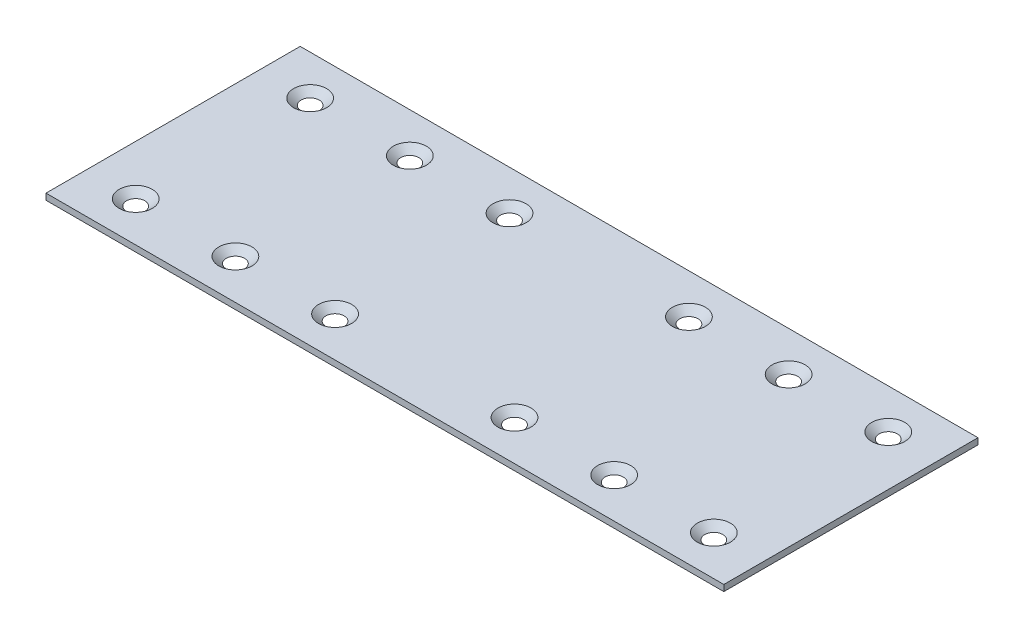
ISO-10303-21;
HEADER;
FILE_DESCRIPTION(('STEP AP214'),'2;1');
FILE_NAME('part.step','',(''),(''),'','','');
FILE_SCHEMA(('AUTOMOTIVE_DESIGN { 1 0 10303 214 1 1 1 1 }'));
ENDSEC;
DATA;
#1=APPLICATION_CONTEXT('core data for automotive mechanical design processes');
#2=APPLICATION_PROTOCOL_DEFINITION('international standard','automotive_design',2000,#1);
#3=PRODUCT_CONTEXT('',#1,'mechanical');
#4=PRODUCT('Part','Part','',(#3));
#5=PRODUCT_RELATED_PRODUCT_CATEGORY('part','',(#4));
#6=PRODUCT_DEFINITION_FORMATION('','',#4);
#7=PRODUCT_DEFINITION_CONTEXT('part definition',#1,'design');
#8=PRODUCT_DEFINITION('design','',#6,#7);
#9=PRODUCT_DEFINITION_SHAPE('','',#8);
#10=(LENGTH_UNIT() NAMED_UNIT(*) SI_UNIT(.MILLI.,.METRE.));
#11=(NAMED_UNIT(*) PLANE_ANGLE_UNIT() SI_UNIT($,.RADIAN.));
#12=(NAMED_UNIT(*) SI_UNIT($,.STERADIAN.) SOLID_ANGLE_UNIT());
#13=UNCERTAINTY_MEASURE_WITH_UNIT(LENGTH_MEASURE(1.E-05),#10,'distance_accuracy_value','');
#14=(GEOMETRIC_REPRESENTATION_CONTEXT(3) GLOBAL_UNCERTAINTY_ASSIGNED_CONTEXT((#13)) GLOBAL_UNIT_ASSIGNED_CONTEXT((#10,
#11,#12)) REPRESENTATION_CONTEXT('',''));
#15=CARTESIAN_POINT('',(0.,0.,0.));
#16=DIRECTION('',(0.,0.,1.));
#17=DIRECTION('',(1.,0.,0.));
#18=AXIS2_PLACEMENT_3D('',#15,#16,#17);
#19=CARTESIAN_POINT('',(0.,1.5875,0.));
#20=DIRECTION('',(0.,-1.,0.));
#21=DIRECTION('',(0.,0.,-1.));
#22=AXIS2_PLACEMENT_3D('',#19,#20,#21);
#23=PLANE('',#22);
#24=CARTESIAN_POINT('',(38.1,1.5875,-54.61));
#25=DIRECTION('',(0.,1.,0.));
#26=DIRECTION('',(0.,0.,1.));
#27=AXIS2_PLACEMENT_3D('',#24,#25,#26);
#28=CIRCLE('',#27,4.2164);
#29=CARTESIAN_POINT('',(38.1,1.5875,-50.3936));
#30=VERTEX_POINT('',#29);
#31=EDGE_CURVE('E238',#30,#30,#28,.T.);
#32=ORIENTED_EDGE('',*,*,#31,.F.);
#33=EDGE_LOOP('',(#32));
#34=FACE_BOUND('',#33,.T.);
#35=CARTESIAN_POINT('',(63.5,1.5875,-54.61));
#36=DIRECTION('',(0.,1.,0.));
#37=DIRECTION('',(0.,0.,1.));
#38=AXIS2_PLACEMENT_3D('',#35,#36,#37);
#39=CIRCLE('',#38,4.21639999999999);
#40=CARTESIAN_POINT('',(63.5,1.5875,-50.3936));
#41=VERTEX_POINT('',#40);
#42=EDGE_CURVE('E245',#41,#41,#39,.T.);
#43=ORIENTED_EDGE('',*,*,#42,.F.);
#44=EDGE_LOOP('',(#43));
#45=FACE_BOUND('',#44,.T.);
#46=CARTESIAN_POINT('',(109.22,1.5875,-54.61));
#47=DIRECTION('',(0.,1.,0.));
#48=DIRECTION('',(0.,0.,1.));
#49=AXIS2_PLACEMENT_3D('',#46,#47,#48);
#50=CIRCLE('',#49,4.21639999999999);
#51=CARTESIAN_POINT('',(109.22,1.5875,-50.3936));
#52=VERTEX_POINT('',#51);
#53=EDGE_CURVE('E251',#52,#52,#50,.T.);
#54=ORIENTED_EDGE('',*,*,#53,.F.);
#55=EDGE_LOOP('',(#54));
#56=FACE_BOUND('',#55,.T.);
#57=CARTESIAN_POINT('',(134.62,1.5875,-54.61));
#58=DIRECTION('',(0.,1.,0.));
#59=DIRECTION('',(0.,0.,1.));
#60=AXIS2_PLACEMENT_3D('',#57,#58,#59);
#61=CIRCLE('',#60,4.21640000000001);
#62=CARTESIAN_POINT('',(134.62,1.5875,-50.3936));
#63=VERTEX_POINT('',#62);
#64=EDGE_CURVE('E133',#63,#63,#61,.T.);
#65=ORIENTED_EDGE('',*,*,#64,.F.);
#66=EDGE_LOOP('',(#65));
#67=FACE_BOUND('',#66,.T.);
#68=CARTESIAN_POINT('',(160.02,1.5875,-54.61));
#69=DIRECTION('',(0.,1.,0.));
#70=DIRECTION('',(0.,0.,1.));
#71=AXIS2_PLACEMENT_3D('',#68,#69,#70);
#72=CIRCLE('',#71,4.21640000000001);
#73=CARTESIAN_POINT('',(160.02,1.5875,-50.3936));
#74=VERTEX_POINT('',#73);
#75=EDGE_CURVE('E121',#74,#74,#72,.T.);
#76=ORIENTED_EDGE('',*,*,#75,.F.);
#77=EDGE_LOOP('',(#76));
#78=FACE_BOUND('',#77,.T.);
#79=CARTESIAN_POINT('',(160.02,1.5875,-10.16));
#80=DIRECTION('',(0.,1.,0.));
#81=DIRECTION('',(0.,0.,1.));
#82=AXIS2_PLACEMENT_3D('',#79,#80,#81);
#83=CIRCLE('',#82,4.21640000000001);
#84=CARTESIAN_POINT('',(160.02,1.5875,-5.94359999999999));
#85=VERTEX_POINT('',#84);
#86=EDGE_CURVE('E120',#85,#85,#83,.T.);
#87=ORIENTED_EDGE('',*,*,#86,.F.);
#88=EDGE_LOOP('',(#87));
#89=FACE_BOUND('',#88,.T.);
#90=CARTESIAN_POINT('',(134.62,1.5875,-10.16));
#91=DIRECTION('',(0.,1.,0.));
#92=DIRECTION('',(0.,0.,1.));
#93=AXIS2_PLACEMENT_3D('',#90,#91,#92);
#94=CIRCLE('',#93,4.21640000000001);
#95=CARTESIAN_POINT('',(134.62,1.5875,-5.94359999999999));
#96=VERTEX_POINT('',#95);
#97=EDGE_CURVE('E117',#96,#96,#94,.T.);
#98=ORIENTED_EDGE('',*,*,#97,.F.);
#99=EDGE_LOOP('',(#98));
#100=FACE_BOUND('',#99,.T.);
#101=CARTESIAN_POINT('',(109.22,1.5875,-10.16));
#102=DIRECTION('',(0.,1.,0.));
#103=DIRECTION('',(0.,0.,1.));
#104=AXIS2_PLACEMENT_3D('',#101,#102,#103);
#105=CIRCLE('',#104,4.21639999999999);
#106=CARTESIAN_POINT('',(109.22,1.5875,-5.94360000000001));
#107=VERTEX_POINT('',#106);
#108=EDGE_CURVE('E116',#107,#107,#105,.T.);
#109=ORIENTED_EDGE('',*,*,#108,.F.);
#110=EDGE_LOOP('',(#109));
#111=FACE_BOUND('',#110,.T.);
#112=CARTESIAN_POINT('',(63.5,1.5875,-10.16));
#113=DIRECTION('',(0.,1.,0.));
#114=DIRECTION('',(0.,0.,1.));
#115=AXIS2_PLACEMENT_3D('',#112,#113,#114);
#116=CIRCLE('',#115,4.21639999999999);
#117=CARTESIAN_POINT('',(63.5,1.5875,-5.94360000000001));
#118=VERTEX_POINT('',#117);
#119=EDGE_CURVE('E146',#118,#118,#116,.T.);
#120=ORIENTED_EDGE('',*,*,#119,.F.);
#121=EDGE_LOOP('',(#120));
#122=FACE_BOUND('',#121,.T.);
#123=CARTESIAN_POINT('',(38.1,1.5875,-10.16));
#124=DIRECTION('',(0.,1.,0.));
#125=DIRECTION('',(0.,0.,1.));
#126=AXIS2_PLACEMENT_3D('',#123,#124,#125);
#127=CIRCLE('',#126,4.2164);
#128=CARTESIAN_POINT('',(38.1,1.5875,-5.9436));
#129=VERTEX_POINT('',#128);
#130=EDGE_CURVE('E113',#129,#129,#127,.T.);
#131=ORIENTED_EDGE('',*,*,#130,.F.);
#132=EDGE_LOOP('',(#131));
#133=FACE_BOUND('',#132,.T.);
#134=CARTESIAN_POINT('',(12.7,1.5875,-10.16));
#135=DIRECTION('',(0.,1.,0.));
#136=DIRECTION('',(0.,0.,1.));
#137=AXIS2_PLACEMENT_3D('',#134,#135,#136);
#138=CIRCLE('',#137,4.2164);
#139=CARTESIAN_POINT('',(12.7,1.5875,-5.9436));
#140=VERTEX_POINT('',#139);
#141=EDGE_CURVE('E112',#140,#140,#138,.T.);
#142=ORIENTED_EDGE('',*,*,#141,.F.);
#143=EDGE_LOOP('',(#142));
#144=FACE_BOUND('',#143,.T.);
#145=DIRECTION('',(0.,0.,1.));
#146=VECTOR('',#145,1.);
#147=CARTESIAN_POINT('',(0.,1.5875,0.));
#148=LINE('',#147,#146);
#149=CARTESIAN_POINT('',(0.,1.5875,-64.77));
#150=VERTEX_POINT('',#149);
#151=CARTESIAN_POINT('',(0.,1.5875,0.));
#152=VERTEX_POINT('',#151);
#153=EDGE_CURVE('E87',#150,#152,#148,.T.);
#154=ORIENTED_EDGE('',*,*,#153,.T.);
#155=DIRECTION('',(1.,0.,0.));
#156=VECTOR('',#155,1.);
#157=CARTESIAN_POINT('',(0.,1.5875,0.));
#158=LINE('',#157,#156);
#159=CARTESIAN_POINT('',(172.72,1.5875,0.));
#160=VERTEX_POINT('',#159);
#161=EDGE_CURVE('E82',#152,#160,#158,.T.);
#162=ORIENTED_EDGE('',*,*,#161,.T.);
#163=DIRECTION('',(0.,0.,-1.));
#164=VECTOR('',#163,1.);
#165=CARTESIAN_POINT('',(172.72,1.5875,0.));
#166=LINE('',#165,#164);
#167=CARTESIAN_POINT('',(172.72,1.5875,-64.77));
#168=VERTEX_POINT('',#167);
#169=EDGE_CURVE('E85',#160,#168,#166,.T.);
#170=ORIENTED_EDGE('',*,*,#169,.T.);
#171=DIRECTION('',(-1.,0.,0.));
#172=VECTOR('',#171,1.);
#173=CARTESIAN_POINT('',(0.,1.5875,-64.77));
#174=LINE('',#173,#172);
#175=EDGE_CURVE('E52',#168,#150,#174,.T.);
#176=ORIENTED_EDGE('',*,*,#175,.T.);
#177=EDGE_LOOP('',(#154,#162,#170,#176));
#178=FACE_BOUND('',#177,.T.);
#179=CARTESIAN_POINT('',(12.7,1.5875,-54.61));
#180=DIRECTION('',(0.,1.,0.));
#181=DIRECTION('',(0.,0.,1.));
#182=AXIS2_PLACEMENT_3D('',#179,#180,#181);
#183=CIRCLE('',#182,4.2164);
#184=CARTESIAN_POINT('',(12.7,1.5875,-50.3936));
#185=VERTEX_POINT('',#184);
#186=EDGE_CURVE('E236',#185,#185,#183,.T.);
#187=ORIENTED_EDGE('',*,*,#186,.F.);
#188=EDGE_LOOP('',(#187));
#189=FACE_BOUND('',#188,.T.);
#190=ADVANCED_FACE('F33',(#34,#45,#56,#67,#78,#89,#100,#111,#122,#133,#144,#178,#189),#23,.F.);
#191=CARTESIAN_POINT('',(0.,1.5875,0.));
#192=DIRECTION('',(1.,0.,0.));
#193=DIRECTION('',(0.,0.,-1.));
#194=AXIS2_PLACEMENT_3D('',#191,#192,#193);
#195=PLANE('',#194);
#196=DIRECTION('',(0.,0.,1.));
#197=VECTOR('',#196,1.);
#198=CARTESIAN_POINT('',(0.,0.,0.));
#199=LINE('',#198,#197);
#200=CARTESIAN_POINT('',(0.,0.,-64.77));
#201=VERTEX_POINT('',#200);
#202=CARTESIAN_POINT('',(0.,0.,0.));
#203=VERTEX_POINT('',#202);
#204=EDGE_CURVE('E100',#201,#203,#199,.T.);
#205=ORIENTED_EDGE('',*,*,#204,.T.);
#206=DIRECTION('',(0.,-1.,0.));
#207=VECTOR('',#206,1.);
#208=CARTESIAN_POINT('',(0.,1.5875,0.));
#209=LINE('',#208,#207);
#210=EDGE_CURVE('E11',#152,#203,#209,.T.);
#211=ORIENTED_EDGE('',*,*,#210,.F.);
#212=ORIENTED_EDGE('',*,*,#153,.F.);
#213=DIRECTION('',(0.,-1.,0.));
#214=VECTOR('',#213,1.);
#215=CARTESIAN_POINT('',(0.,1.5875,-64.77));
#216=LINE('',#215,#214);
#217=EDGE_CURVE('E96',#150,#201,#216,.T.);
#218=ORIENTED_EDGE('',*,*,#217,.T.);
#219=EDGE_LOOP('',(#205,#211,#212,#218));
#220=FACE_BOUND('',#219,.T.);
#221=ADVANCED_FACE('F35',(#220),#195,.F.);
#222=CARTESIAN_POINT('',(0.,1.5875,0.));
#223=DIRECTION('',(0.,0.,-1.));
#224=DIRECTION('',(-1.,0.,0.));
#225=AXIS2_PLACEMENT_3D('',#222,#223,#224);
#226=PLANE('',#225);
#227=DIRECTION('',(1.,0.,0.));
#228=VECTOR('',#227,1.);
#229=CARTESIAN_POINT('',(0.,0.,0.));
#230=LINE('',#229,#228);
#231=CARTESIAN_POINT('',(172.72,0.,0.));
#232=VERTEX_POINT('',#231);
#233=EDGE_CURVE('E91',#203,#232,#230,.T.);
#234=ORIENTED_EDGE('',*,*,#233,.T.);
#235=DIRECTION('',(0.,-1.,0.));
#236=VECTOR('',#235,1.);
#237=CARTESIAN_POINT('',(172.72,1.5875,0.));
#238=LINE('',#237,#236);
#239=EDGE_CURVE('E43',#160,#232,#238,.T.);
#240=ORIENTED_EDGE('',*,*,#239,.F.);
#241=ORIENTED_EDGE('',*,*,#161,.F.);
#242=ORIENTED_EDGE('',*,*,#210,.T.);
#243=EDGE_LOOP('',(#234,#240,#241,#242));
#244=FACE_BOUND('',#243,.T.);
#245=ADVANCED_FACE('F90',(#244),#226,.F.);
#246=CARTESIAN_POINT('',(172.72,1.5875,0.));
#247=DIRECTION('',(-1.,0.,0.));
#248=DIRECTION('',(0.,0.,1.));
#249=AXIS2_PLACEMENT_3D('',#246,#247,#248);
#250=PLANE('',#249);
#251=DIRECTION('',(0.,0.,-1.));
#252=VECTOR('',#251,1.);
#253=CARTESIAN_POINT('',(172.72,0.,0.));
#254=LINE('',#253,#252);
#255=CARTESIAN_POINT('',(172.72,0.,-64.77));
#256=VERTEX_POINT('',#255);
#257=EDGE_CURVE('E69',#232,#256,#254,.T.);
#258=ORIENTED_EDGE('',*,*,#257,.T.);
#259=DIRECTION('',(0.,-1.,0.));
#260=VECTOR('',#259,1.);
#261=CARTESIAN_POINT('',(172.72,1.5875,-64.77));
#262=LINE('',#261,#260);
#263=EDGE_CURVE('E92',#168,#256,#262,.T.);
#264=ORIENTED_EDGE('',*,*,#263,.F.);
#265=ORIENTED_EDGE('',*,*,#169,.F.);
#266=ORIENTED_EDGE('',*,*,#239,.T.);
#267=EDGE_LOOP('',(#258,#264,#265,#266));
#268=FACE_BOUND('',#267,.T.);
#269=ADVANCED_FACE('F94',(#268),#250,.F.);
#270=CARTESIAN_POINT('',(0.,1.5875,-64.77));
#271=DIRECTION('',(0.,0.,1.));
#272=DIRECTION('',(1.,0.,0.));
#273=AXIS2_PLACEMENT_3D('',#270,#271,#272);
#274=PLANE('',#273);
#275=DIRECTION('',(-1.,0.,0.));
#276=VECTOR('',#275,1.);
#277=CARTESIAN_POINT('',(0.,0.,-64.77));
#278=LINE('',#277,#276);
#279=EDGE_CURVE('E75',#256,#201,#278,.T.);
#280=ORIENTED_EDGE('',*,*,#279,.T.);
#281=ORIENTED_EDGE('',*,*,#217,.F.);
#282=ORIENTED_EDGE('',*,*,#175,.F.);
#283=ORIENTED_EDGE('',*,*,#263,.T.);
#284=EDGE_LOOP('',(#280,#281,#282,#283));
#285=FACE_BOUND('',#284,.T.);
#286=ADVANCED_FACE('F165',(#285),#274,.F.);
#287=CARTESIAN_POINT('',(0.,0.,0.));
#288=DIRECTION('',(0.,-1.,0.));
#289=DIRECTION('',(0.,0.,-1.));
#290=AXIS2_PLACEMENT_3D('',#287,#288,#289);
#291=PLANE('',#290);
#292=CARTESIAN_POINT('',(12.7,0.,-54.61));
#293=DIRECTION('',(0.,-1.,0.));
#294=DIRECTION('',(0.,0.,-1.));
#295=AXIS2_PLACEMENT_3D('',#292,#293,#294);
#296=CIRCLE('',#295,2.32449117175669);
#297=CARTESIAN_POINT('',(12.7,0.,-56.9344911717567));
#298=VERTEX_POINT('',#297);
#299=EDGE_CURVE('E37',#298,#298,#296,.T.);
#300=ORIENTED_EDGE('',*,*,#299,.F.);
#301=EDGE_LOOP('',(#300));
#302=FACE_BOUND('',#301,.T.);
#303=CARTESIAN_POINT('',(38.1,0.,-54.61));
#304=DIRECTION('',(0.,-1.,0.));
#305=DIRECTION('',(0.,0.,-1.));
#306=AXIS2_PLACEMENT_3D('',#303,#304,#305);
#307=CIRCLE('',#306,2.32449117175669);
#308=CARTESIAN_POINT('',(38.1,0.,-56.9344911717567));
#309=VERTEX_POINT('',#308);
#310=EDGE_CURVE('E242',#309,#309,#307,.T.);
#311=ORIENTED_EDGE('',*,*,#310,.F.);
#312=EDGE_LOOP('',(#311));
#313=FACE_BOUND('',#312,.T.);
#314=CARTESIAN_POINT('',(63.5,0.,-54.61));
#315=DIRECTION('',(0.,-1.,0.));
#316=DIRECTION('',(0.,0.,-1.));
#317=AXIS2_PLACEMENT_3D('',#314,#315,#316);
#318=CIRCLE('',#317,2.32449117175669);
#319=CARTESIAN_POINT('',(63.5,0.,-56.9344911717567));
#320=VERTEX_POINT('',#319);
#321=EDGE_CURVE('E248',#320,#320,#318,.T.);
#322=ORIENTED_EDGE('',*,*,#321,.F.);
#323=EDGE_LOOP('',(#322));
#324=FACE_BOUND('',#323,.T.);
#325=CARTESIAN_POINT('',(109.22,0.,-54.61));
#326=DIRECTION('',(0.,-1.,0.));
#327=DIRECTION('',(0.,0.,-1.));
#328=AXIS2_PLACEMENT_3D('',#325,#326,#327);
#329=CIRCLE('',#328,2.32449117175669);
#330=CARTESIAN_POINT('',(109.22,0.,-56.9344911717567));
#331=VERTEX_POINT('',#330);
#332=EDGE_CURVE('E254',#331,#331,#329,.T.);
#333=ORIENTED_EDGE('',*,*,#332,.F.);
#334=EDGE_LOOP('',(#333));
#335=FACE_BOUND('',#334,.T.);
#336=CARTESIAN_POINT('',(134.62,0.,-54.61));
#337=DIRECTION('',(0.,-1.,0.));
#338=DIRECTION('',(0.,0.,-1.));
#339=AXIS2_PLACEMENT_3D('',#336,#337,#338);
#340=CIRCLE('',#339,2.32449117175669);
#341=CARTESIAN_POINT('',(134.62,0.,-56.9344911717567));
#342=VERTEX_POINT('',#341);
#343=EDGE_CURVE('E128',#342,#342,#340,.T.);
#344=ORIENTED_EDGE('',*,*,#343,.F.);
#345=EDGE_LOOP('',(#344));
#346=FACE_BOUND('',#345,.T.);
#347=CARTESIAN_POINT('',(160.02,0.,-54.61));
#348=DIRECTION('',(0.,-1.,0.));
#349=DIRECTION('',(0.,0.,-1.));
#350=AXIS2_PLACEMENT_3D('',#347,#348,#349);
#351=CIRCLE('',#350,2.32449117175669);
#352=CARTESIAN_POINT('',(160.02,0.,-56.9344911717567));
#353=VERTEX_POINT('',#352);
#354=EDGE_CURVE('E118',#353,#353,#351,.T.);
#355=ORIENTED_EDGE('',*,*,#354,.F.);
#356=EDGE_LOOP('',(#355));
#357=FACE_BOUND('',#356,.T.);
#358=CARTESIAN_POINT('',(160.02,0.,-10.16));
#359=DIRECTION('',(0.,-1.,0.));
#360=DIRECTION('',(0.,0.,-1.));
#361=AXIS2_PLACEMENT_3D('',#358,#359,#360);
#362=CIRCLE('',#361,2.32449117175669);
#363=CARTESIAN_POINT('',(160.02,0.,-12.4844911717567));
#364=VERTEX_POINT('',#363);
#365=EDGE_CURVE('E125',#364,#364,#362,.T.);
#366=ORIENTED_EDGE('',*,*,#365,.F.);
#367=EDGE_LOOP('',(#366));
#368=FACE_BOUND('',#367,.T.);
#369=CARTESIAN_POINT('',(134.62,0.,-10.16));
#370=DIRECTION('',(0.,-1.,0.));
#371=DIRECTION('',(0.,0.,-1.));
#372=AXIS2_PLACEMENT_3D('',#369,#370,#371);
#373=CIRCLE('',#372,2.32449117175669);
#374=CARTESIAN_POINT('',(134.62,0.,-12.4844911717567));
#375=VERTEX_POINT('',#374);
#376=EDGE_CURVE('E114',#375,#375,#373,.T.);
#377=ORIENTED_EDGE('',*,*,#376,.F.);
#378=EDGE_LOOP('',(#377));
#379=FACE_BOUND('',#378,.T.);
#380=CARTESIAN_POINT('',(109.22,0.,-10.16));
#381=DIRECTION('',(0.,-1.,0.));
#382=DIRECTION('',(0.,0.,-1.));
#383=AXIS2_PLACEMENT_3D('',#380,#381,#382);
#384=CIRCLE('',#383,2.32449117175669);
#385=CARTESIAN_POINT('',(109.22,0.,-12.4844911717567));
#386=VERTEX_POINT('',#385);
#387=EDGE_CURVE('E143',#386,#386,#384,.T.);
#388=ORIENTED_EDGE('',*,*,#387,.F.);
#389=EDGE_LOOP('',(#388));
#390=FACE_BOUND('',#389,.T.);
#391=CARTESIAN_POINT('',(63.5,0.,-10.16));
#392=DIRECTION('',(0.,-1.,0.));
#393=DIRECTION('',(0.,0.,-1.));
#394=AXIS2_PLACEMENT_3D('',#391,#392,#393);
#395=CIRCLE('',#394,2.32449117175669);
#396=CARTESIAN_POINT('',(63.5,0.,-12.4844911717567));
#397=VERTEX_POINT('',#396);
#398=EDGE_CURVE('E149',#397,#397,#395,.T.);
#399=ORIENTED_EDGE('',*,*,#398,.F.);
#400=EDGE_LOOP('',(#399));
#401=FACE_BOUND('',#400,.T.);
#402=CARTESIAN_POINT('',(38.1,0.,-10.16));
#403=DIRECTION('',(0.,-1.,0.));
#404=DIRECTION('',(0.,0.,-1.));
#405=AXIS2_PLACEMENT_3D('',#402,#403,#404);
#406=CIRCLE('',#405,2.32449117175669);
#407=CARTESIAN_POINT('',(38.1,0.,-12.4844911717567));
#408=VERTEX_POINT('',#407);
#409=EDGE_CURVE('E109',#408,#408,#406,.T.);
#410=ORIENTED_EDGE('',*,*,#409,.F.);
#411=EDGE_LOOP('',(#410));
#412=FACE_BOUND('',#411,.T.);
#413=CARTESIAN_POINT('',(12.7,0.,-10.16));
#414=DIRECTION('',(0.,-1.,0.));
#415=DIRECTION('',(0.,0.,-1.));
#416=AXIS2_PLACEMENT_3D('',#413,#414,#415);
#417=CIRCLE('',#416,2.32449117175669);
#418=CARTESIAN_POINT('',(12.7,0.,-12.4844911717567));
#419=VERTEX_POINT('',#418);
#420=EDGE_CURVE('E103',#419,#419,#417,.T.);
#421=ORIENTED_EDGE('',*,*,#420,.F.);
#422=EDGE_LOOP('',(#421));
#423=FACE_BOUND('',#422,.T.);
#424=ORIENTED_EDGE('',*,*,#204,.F.);
#425=ORIENTED_EDGE('',*,*,#279,.F.);
#426=ORIENTED_EDGE('',*,*,#257,.F.);
#427=ORIENTED_EDGE('',*,*,#233,.F.);
#428=EDGE_LOOP('',(#424,#425,#426,#427));
#429=FACE_BOUND('',#428,.T.);
#430=ADVANCED_FACE('F162',(#302,#313,#324,#335,#346,#357,#368,#379,#390,#401,#412,#423,#429),
#291,.T.);
#431=CARTESIAN_POINT('',(12.7,1.5875,-10.16));
#432=DIRECTION('',(0.,1.,0.));
#433=DIRECTION('',(0.,0.,1.));
#434=AXIS2_PLACEMENT_3D('',#431,#432,#433);
#435=CONICAL_SURFACE('',#434,4.2164,0.872664625997165);
#436=ORIENTED_EDGE('',*,*,#420,.T.);
#437=EDGE_LOOP('',(#436));
#438=FACE_BOUND('',#437,.T.);
#439=ORIENTED_EDGE('',*,*,#141,.T.);
#440=EDGE_LOOP('',(#439));
#441=FACE_BOUND('',#440,.T.);
#442=ADVANCED_FACE('F159',(#438,#441),#435,.F.);
#443=CARTESIAN_POINT('',(38.1,1.5875,-10.16));
#444=DIRECTION('',(0.,1.,0.));
#445=DIRECTION('',(0.,0.,1.));
#446=AXIS2_PLACEMENT_3D('',#443,#444,#445);
#447=CONICAL_SURFACE('',#446,4.2164,0.872664625997165);
#448=ORIENTED_EDGE('',*,*,#409,.T.);
#449=EDGE_LOOP('',(#448));
#450=FACE_BOUND('',#449,.T.);
#451=ORIENTED_EDGE('',*,*,#130,.T.);
#452=EDGE_LOOP('',(#451));
#453=FACE_BOUND('',#452,.T.);
#454=ADVANCED_FACE('F187',(#450,#453),#447,.F.);
#455=CARTESIAN_POINT('',(63.5,1.5875,-10.16));
#456=DIRECTION('',(0.,1.,0.));
#457=DIRECTION('',(0.,0.,1.));
#458=AXIS2_PLACEMENT_3D('',#455,#456,#457);
#459=CONICAL_SURFACE('',#458,4.21639999999999,0.872664625997164);
#460=ORIENTED_EDGE('',*,*,#398,.T.);
#461=EDGE_LOOP('',(#460));
#462=FACE_BOUND('',#461,.T.);
#463=ORIENTED_EDGE('',*,*,#119,.T.);
#464=EDGE_LOOP('',(#463));
#465=FACE_BOUND('',#464,.T.);
#466=ADVANCED_FACE('F190',(#462,#465),#459,.F.);
#467=CARTESIAN_POINT('',(109.22,1.5875,-10.16));
#468=DIRECTION('',(0.,1.,0.));
#469=DIRECTION('',(0.,0.,1.));
#470=AXIS2_PLACEMENT_3D('',#467,#468,#469);
#471=CONICAL_SURFACE('',#470,4.21639999999999,0.872664625997164);
#472=ORIENTED_EDGE('',*,*,#387,.T.);
#473=EDGE_LOOP('',(#472));
#474=FACE_BOUND('',#473,.T.);
#475=ORIENTED_EDGE('',*,*,#108,.T.);
#476=EDGE_LOOP('',(#475));
#477=FACE_BOUND('',#476,.T.);
#478=ADVANCED_FACE('F194',(#474,#477),#471,.F.);
#479=CARTESIAN_POINT('',(134.62,1.5875,-10.16));
#480=DIRECTION('',(0.,1.,0.));
#481=DIRECTION('',(0.,0.,1.));
#482=AXIS2_PLACEMENT_3D('',#479,#480,#481);
#483=CONICAL_SURFACE('',#482,4.21640000000001,0.872664625997167);
#484=ORIENTED_EDGE('',*,*,#376,.T.);
#485=EDGE_LOOP('',(#484));
#486=FACE_BOUND('',#485,.T.);
#487=ORIENTED_EDGE('',*,*,#97,.T.);
#488=EDGE_LOOP('',(#487));
#489=FACE_BOUND('',#488,.T.);
#490=ADVANCED_FACE('F198',(#486,#489),#483,.F.);
#491=CARTESIAN_POINT('',(160.02,1.5875,-10.16));
#492=DIRECTION('',(0.,1.,0.));
#493=DIRECTION('',(0.,0.,1.));
#494=AXIS2_PLACEMENT_3D('',#491,#492,#493);
#495=CONICAL_SURFACE('',#494,4.21640000000001,0.872664625997167);
#496=ORIENTED_EDGE('',*,*,#365,.T.);
#497=EDGE_LOOP('',(#496));
#498=FACE_BOUND('',#497,.T.);
#499=ORIENTED_EDGE('',*,*,#86,.T.);
#500=EDGE_LOOP('',(#499));
#501=FACE_BOUND('',#500,.T.);
#502=ADVANCED_FACE('F202',(#498,#501),#495,.F.);
#503=CARTESIAN_POINT('',(160.02,1.5875,-54.61));
#504=DIRECTION('',(0.,1.,0.));
#505=DIRECTION('',(0.,0.,1.));
#506=AXIS2_PLACEMENT_3D('',#503,#504,#505);
#507=CONICAL_SURFACE('',#506,4.21640000000001,0.872664625997167);
#508=ORIENTED_EDGE('',*,*,#354,.T.);
#509=EDGE_LOOP('',(#508));
#510=FACE_BOUND('',#509,.T.);
#511=ORIENTED_EDGE('',*,*,#75,.T.);
#512=EDGE_LOOP('',(#511));
#513=FACE_BOUND('',#512,.T.);
#514=ADVANCED_FACE('F206',(#510,#513),#507,.F.);
#515=CARTESIAN_POINT('',(134.62,1.5875,-54.61));
#516=DIRECTION('',(0.,1.,0.));
#517=DIRECTION('',(0.,0.,1.));
#518=AXIS2_PLACEMENT_3D('',#515,#516,#517);
#519=CONICAL_SURFACE('',#518,4.21640000000001,0.872664625997167);
#520=ORIENTED_EDGE('',*,*,#343,.T.);
#521=EDGE_LOOP('',(#520));
#522=FACE_BOUND('',#521,.T.);
#523=ORIENTED_EDGE('',*,*,#64,.T.);
#524=EDGE_LOOP('',(#523));
#525=FACE_BOUND('',#524,.T.);
#526=ADVANCED_FACE('F210',(#522,#525),#519,.F.);
#527=CARTESIAN_POINT('',(109.22,1.5875,-54.61));
#528=DIRECTION('',(0.,1.,0.));
#529=DIRECTION('',(0.,0.,1.));
#530=AXIS2_PLACEMENT_3D('',#527,#528,#529);
#531=CONICAL_SURFACE('',#530,4.21639999999999,0.872664625997164);
#532=ORIENTED_EDGE('',*,*,#332,.T.);
#533=EDGE_LOOP('',(#532));
#534=FACE_BOUND('',#533,.T.);
#535=ORIENTED_EDGE('',*,*,#53,.T.);
#536=EDGE_LOOP('',(#535));
#537=FACE_BOUND('',#536,.T.);
#538=ADVANCED_FACE('F213',(#534,#537),#531,.F.);
#539=CARTESIAN_POINT('',(63.5,1.5875,-54.61));
#540=DIRECTION('',(0.,1.,0.));
#541=DIRECTION('',(0.,0.,1.));
#542=AXIS2_PLACEMENT_3D('',#539,#540,#541);
#543=CONICAL_SURFACE('',#542,4.21639999999999,0.872664625997164);
#544=ORIENTED_EDGE('',*,*,#321,.T.);
#545=EDGE_LOOP('',(#544));
#546=FACE_BOUND('',#545,.T.);
#547=ORIENTED_EDGE('',*,*,#42,.T.);
#548=EDGE_LOOP('',(#547));
#549=FACE_BOUND('',#548,.T.);
#550=ADVANCED_FACE('F217',(#546,#549),#543,.F.);
#551=CARTESIAN_POINT('',(38.1,1.5875,-54.61));
#552=DIRECTION('',(0.,1.,0.));
#553=DIRECTION('',(0.,0.,1.));
#554=AXIS2_PLACEMENT_3D('',#551,#552,#553);
#555=CONICAL_SURFACE('',#554,4.2164,0.872664625997165);
#556=ORIENTED_EDGE('',*,*,#310,.T.);
#557=EDGE_LOOP('',(#556));
#558=FACE_BOUND('',#557,.T.);
#559=ORIENTED_EDGE('',*,*,#31,.T.);
#560=EDGE_LOOP('',(#559));
#561=FACE_BOUND('',#560,.T.);
#562=ADVANCED_FACE('F221',(#558,#561),#555,.F.);
#563=CARTESIAN_POINT('',(12.7,1.5875,-54.61));
#564=DIRECTION('',(0.,1.,0.));
#565=DIRECTION('',(0.,0.,1.));
#566=AXIS2_PLACEMENT_3D('',#563,#564,#565);
#567=CONICAL_SURFACE('',#566,4.2164,0.872664625997165);
#568=ORIENTED_EDGE('',*,*,#299,.T.);
#569=EDGE_LOOP('',(#568));
#570=FACE_BOUND('',#569,.T.);
#571=ORIENTED_EDGE('',*,*,#186,.T.);
#572=EDGE_LOOP('',(#571));
#573=FACE_BOUND('',#572,.T.);
#574=ADVANCED_FACE('F225',(#570,#573),#567,.F.);
#575=CLOSED_SHELL('',(#190,#221,#245,#269,#286,#430,#442,#454,#466,#478,#490,#502,#514,#526,
#538,#550,#562,#574));
#576=MANIFOLD_SOLID_BREP('B2',#575);
#577=ADVANCED_BREP_SHAPE_REPRESENTATION('',(#18,#576),#14);
#578=SHAPE_DEFINITION_REPRESENTATION(#9,#577);
ENDSEC;
END-ISO-10303-21;
